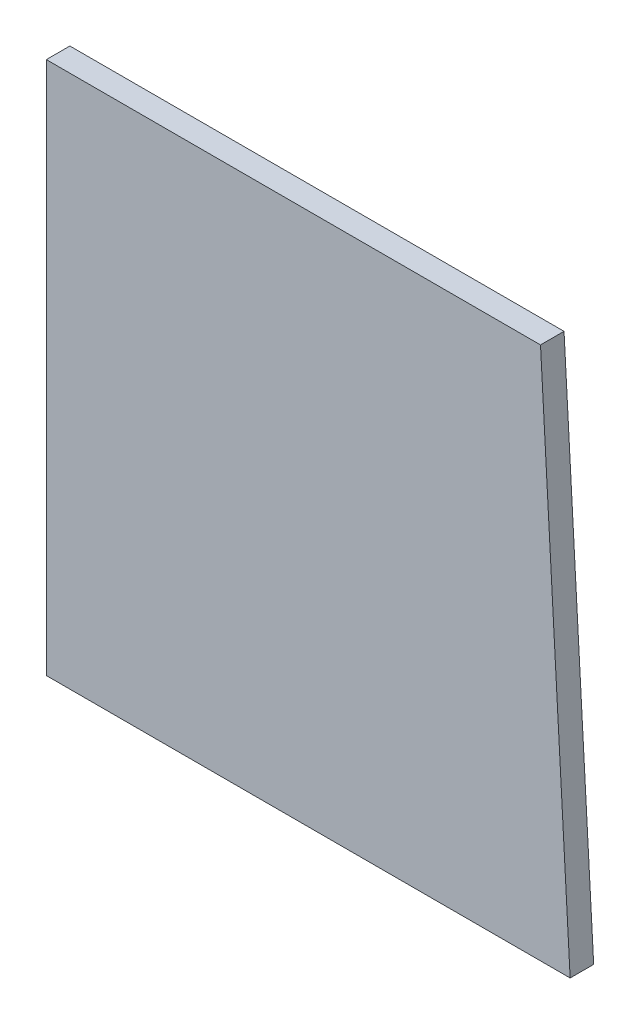
ISO-10303-21;
HEADER;
FILE_DESCRIPTION(('STEP AP214'),'2;1');
FILE_NAME('part.step','',(''),(''),'','','');
FILE_SCHEMA(('AUTOMOTIVE_DESIGN { 1 0 10303 214 1 1 1 1 }'));
ENDSEC;
DATA;
#1=APPLICATION_CONTEXT('core data for automotive mechanical design processes');
#2=APPLICATION_PROTOCOL_DEFINITION('international standard','automotive_design',2000,#1);
#3=PRODUCT_CONTEXT('',#1,'mechanical');
#4=PRODUCT('Part','Part','',(#3));
#5=PRODUCT_RELATED_PRODUCT_CATEGORY('part','',(#4));
#6=PRODUCT_DEFINITION_FORMATION('','',#4);
#7=PRODUCT_DEFINITION_CONTEXT('part definition',#1,'design');
#8=PRODUCT_DEFINITION('design','',#6,#7);
#9=PRODUCT_DEFINITION_SHAPE('','',#8);
#10=(LENGTH_UNIT() NAMED_UNIT(*) SI_UNIT(.MILLI.,.METRE.));
#11=(NAMED_UNIT(*) PLANE_ANGLE_UNIT() SI_UNIT($,.RADIAN.));
#12=(NAMED_UNIT(*) SI_UNIT($,.STERADIAN.) SOLID_ANGLE_UNIT());
#13=UNCERTAINTY_MEASURE_WITH_UNIT(LENGTH_MEASURE(1.E-05),#10,'distance_accuracy_value','');
#14=(GEOMETRIC_REPRESENTATION_CONTEXT(3) GLOBAL_UNCERTAINTY_ASSIGNED_CONTEXT((#13)) GLOBAL_UNIT_ASSIGNED_CONTEXT((#10,
#11,#12)) REPRESENTATION_CONTEXT('',''));
#15=CARTESIAN_POINT('',(0.,0.,0.));
#16=DIRECTION('',(0.,0.,1.));
#17=DIRECTION('',(1.,0.,0.));
#18=AXIS2_PLACEMENT_3D('',#15,#16,#17);
#19=CARTESIAN_POINT('',(-33.5907944334726,34.8199583460327,3.));
#20=DIRECTION('',(1.,0.,0.));
#21=DIRECTION('',(0.,0.,-1.));
#22=AXIS2_PLACEMENT_3D('',#19,#20,#21);
#23=PLANE('',#22);
#24=DIRECTION('',(0.,-1.,0.));
#25=VECTOR('',#24,1.);
#26=CARTESIAN_POINT('',(-33.5907944334726,34.8199583460327,0.));
#27=LINE('',#26,#25);
#28=CARTESIAN_POINT('',(-33.5907944334726,34.8199583460327,0.));
#29=VERTEX_POINT('',#28);
#30=CARTESIAN_POINT('',(-33.5907944334726,-33.1800416539673,0.));
#31=VERTEX_POINT('',#30);
#32=EDGE_CURVE('E99',#29,#31,#27,.T.);
#33=ORIENTED_EDGE('',*,*,#32,.T.);
#34=DIRECTION('',(0.,0.,-1.));
#35=VECTOR('',#34,1.);
#36=CARTESIAN_POINT('',(-33.5907944334726,-33.1800416539673,3.));
#37=LINE('',#36,#35);
#38=CARTESIAN_POINT('',(-33.5907944334726,-33.1800416539673,3.));
#39=VERTEX_POINT('',#38);
#40=EDGE_CURVE('E11',#39,#31,#37,.T.);
#41=ORIENTED_EDGE('',*,*,#40,.F.);
#42=DIRECTION('',(0.,-1.,0.));
#43=VECTOR('',#42,1.);
#44=CARTESIAN_POINT('',(-33.5907944334726,34.8199583460327,3.));
#45=LINE('',#44,#43);
#46=CARTESIAN_POINT('',(-33.5907944334726,34.8199583460327,3.));
#47=VERTEX_POINT('',#46);
#48=EDGE_CURVE('E87',#47,#39,#45,.T.);
#49=ORIENTED_EDGE('',*,*,#48,.F.);
#50=DIRECTION('',(0.,0.,-1.));
#51=VECTOR('',#50,1.);
#52=CARTESIAN_POINT('',(-33.5907944334726,34.8199583460327,3.));
#53=LINE('',#52,#51);
#54=EDGE_CURVE('E95',#47,#29,#53,.T.);
#55=ORIENTED_EDGE('',*,*,#54,.T.);
#56=EDGE_LOOP('',(#33,#41,#49,#55));
#57=FACE_BOUND('',#56,.T.);
#58=ADVANCED_FACE('F36',(#57),#23,.F.);
#59=CARTESIAN_POINT('',(-33.5907944334726,-33.1800416539673,3.));
#60=DIRECTION('',(0.,1.,0.));
#61=DIRECTION('',(0.,0.,1.));
#62=AXIS2_PLACEMENT_3D('',#59,#60,#61);
#63=PLANE('',#62);
#64=DIRECTION('',(1.,0.,0.));
#65=VECTOR('',#64,1.);
#66=CARTESIAN_POINT('',(-33.5907944334726,-33.1800416539673,0.));
#67=LINE('',#66,#65);
#68=CARTESIAN_POINT('',(33.1808152604563,-33.1800416539673,0.));
#69=VERTEX_POINT('',#68);
#70=EDGE_CURVE('E91',#31,#69,#67,.T.);
#71=ORIENTED_EDGE('',*,*,#70,.T.);
#72=DIRECTION('',(0.,0.,-1.));
#73=VECTOR('',#72,1.);
#74=CARTESIAN_POINT('',(33.1808152604563,-33.1800416539673,3.));
#75=LINE('',#74,#73);
#76=CARTESIAN_POINT('',(33.1808152604563,-33.1800416539673,3.));
#77=VERTEX_POINT('',#76);
#78=EDGE_CURVE('E44',#77,#69,#75,.T.);
#79=ORIENTED_EDGE('',*,*,#78,.F.);
#80=DIRECTION('',(1.,0.,0.));
#81=VECTOR('',#80,1.);
#82=CARTESIAN_POINT('',(-33.5907944334726,-33.1800416539673,3.));
#83=LINE('',#82,#81);
#84=EDGE_CURVE('E82',#39,#77,#83,.T.);
#85=ORIENTED_EDGE('',*,*,#84,.F.);
#86=ORIENTED_EDGE('',*,*,#40,.T.);
#87=EDGE_LOOP('',(#71,#79,#85,#86));
#88=FACE_BOUND('',#87,.T.);
#89=ADVANCED_FACE('F90',(#88),#63,.F.);
#90=CARTESIAN_POINT('',(29.4030374826785,34.8199583460327,3.));
#91=DIRECTION('',(-0.998460353205412,-0.055470019622523,0.));
#92=DIRECTION('',(0.055470019622523,-0.998460353205413,0.));
#93=AXIS2_PLACEMENT_3D('',#90,#91,#92);
#94=PLANE('',#93);
#95=DIRECTION('',(-0.055470019622523,0.998460353205412,0.));
#96=VECTOR('',#95,1.);
#97=CARTESIAN_POINT('',(29.4030374826785,34.8199583460327,0.));
#98=LINE('',#97,#96);
#99=CARTESIAN_POINT('',(29.4030374826785,34.8199583460327,0.));
#100=VERTEX_POINT('',#99);
#101=EDGE_CURVE('E69',#69,#100,#98,.T.);
#102=ORIENTED_EDGE('',*,*,#101,.T.);
#103=DIRECTION('',(0.,0.,-1.));
#104=VECTOR('',#103,1.);
#105=CARTESIAN_POINT('',(29.4030374826785,34.8199583460327,3.));
#106=LINE('',#105,#104);
#107=CARTESIAN_POINT('',(29.4030374826785,34.8199583460327,3.));
#108=VERTEX_POINT('',#107);
#109=EDGE_CURVE('E92',#108,#100,#106,.T.);
#110=ORIENTED_EDGE('',*,*,#109,.F.);
#111=DIRECTION('',(-0.055470019622523,0.998460353205412,0.));
#112=VECTOR('',#111,1.);
#113=CARTESIAN_POINT('',(29.4030374826785,34.8199583460327,3.));
#114=LINE('',#113,#112);
#115=EDGE_CURVE('E85',#77,#108,#114,.T.);
#116=ORIENTED_EDGE('',*,*,#115,.F.);
#117=ORIENTED_EDGE('',*,*,#78,.T.);
#118=EDGE_LOOP('',(#102,#110,#116,#117));
#119=FACE_BOUND('',#118,.T.);
#120=ADVANCED_FACE('F93',(#119),#94,.F.);
#121=CARTESIAN_POINT('',(29.4030374826785,34.8199583460327,3.));
#122=DIRECTION('',(0.,-1.,0.));
#123=DIRECTION('',(1.,0.,0.));
#124=AXIS2_PLACEMENT_3D('',#121,#122,#123);
#125=PLANE('',#124);
#126=DIRECTION('',(-1.,0.,0.));
#127=VECTOR('',#126,1.);
#128=CARTESIAN_POINT('',(29.4030374826785,34.8199583460327,0.));
#129=LINE('',#128,#127);
#130=EDGE_CURVE('E75',#100,#29,#129,.T.);
#131=ORIENTED_EDGE('',*,*,#130,.T.);
#132=ORIENTED_EDGE('',*,*,#54,.F.);
#133=DIRECTION('',(-1.,0.,0.));
#134=VECTOR('',#133,1.);
#135=CARTESIAN_POINT('',(29.4030374826785,34.8199583460327,3.));
#136=LINE('',#135,#134);
#137=EDGE_CURVE('E52',#108,#47,#136,.T.);
#138=ORIENTED_EDGE('',*,*,#137,.F.);
#139=ORIENTED_EDGE('',*,*,#109,.T.);
#140=EDGE_LOOP('',(#131,#132,#138,#139));
#141=FACE_BOUND('',#140,.T.);
#142=ADVANCED_FACE('F106',(#141),#125,.F.);
#143=CARTESIAN_POINT('',(0.,0.,3.));
#144=DIRECTION('',(0.,0.,1.));
#145=DIRECTION('',(1.,0.,0.));
#146=AXIS2_PLACEMENT_3D('',#143,#144,#145);
#147=PLANE('',#146);
#148=ORIENTED_EDGE('',*,*,#48,.T.);
#149=ORIENTED_EDGE('',*,*,#84,.T.);
#150=ORIENTED_EDGE('',*,*,#115,.T.);
#151=ORIENTED_EDGE('',*,*,#137,.T.);
#152=EDGE_LOOP('',(#148,#149,#150,#151));
#153=FACE_BOUND('',#152,.T.);
#154=ADVANCED_FACE('F83',(#153),#147,.T.);
#155=CARTESIAN_POINT('',(0.,0.,0.));
#156=DIRECTION('',(0.,0.,1.));
#157=DIRECTION('',(1.,0.,0.));
#158=AXIS2_PLACEMENT_3D('',#155,#156,#157);
#159=PLANE('',#158);
#160=ORIENTED_EDGE('',*,*,#32,.F.);
#161=ORIENTED_EDGE('',*,*,#130,.F.);
#162=ORIENTED_EDGE('',*,*,#101,.F.);
#163=ORIENTED_EDGE('',*,*,#70,.F.);
#164=EDGE_LOOP('',(#160,#161,#162,#163));
#165=FACE_BOUND('',#164,.T.);
#166=ADVANCED_FACE('F109',(#165),#159,.F.);
#167=CLOSED_SHELL('',(#58,#89,#120,#142,#154,#166));
#168=MANIFOLD_SOLID_BREP('B2',#167);
#169=ADVANCED_BREP_SHAPE_REPRESENTATION('',(#18,#168),#14);
#170=SHAPE_DEFINITION_REPRESENTATION(#9,#169);
ENDSEC;
END-ISO-10303-21;
